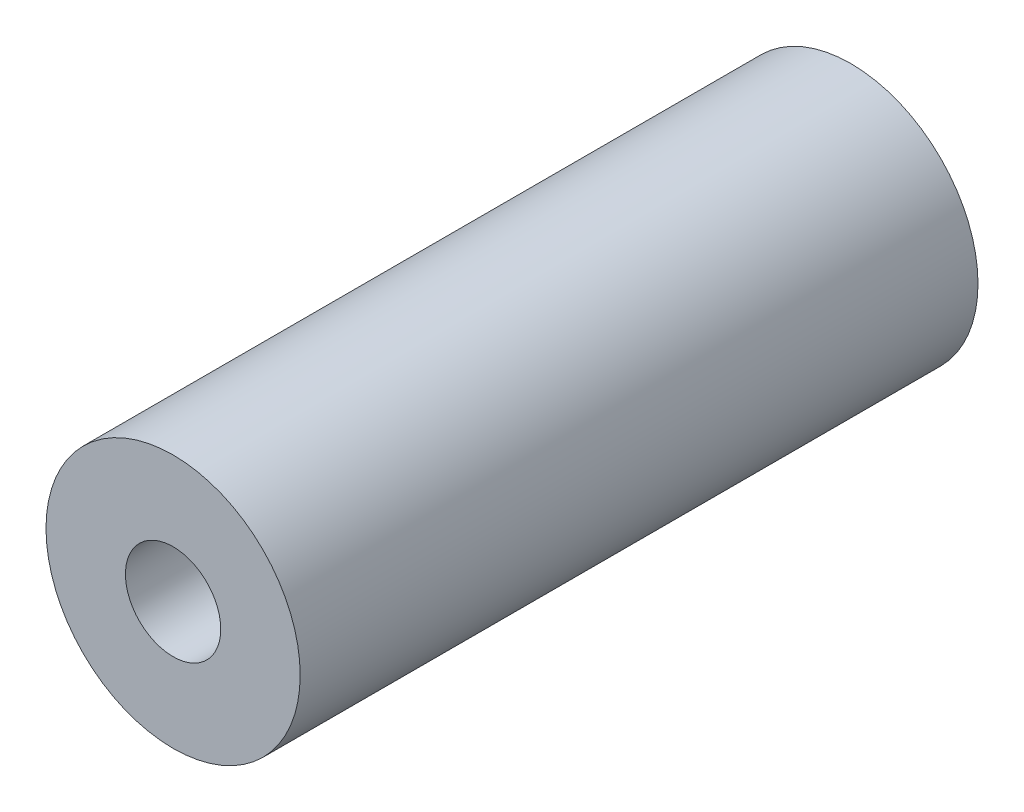
ISO-10303-21;
HEADER;
FILE_DESCRIPTION(('STEP AP214'),'2;1');
FILE_NAME('part.step','',(''),(''),'','','');
FILE_SCHEMA(('AUTOMOTIVE_DESIGN { 1 0 10303 214 1 1 1 1 }'));
ENDSEC;
DATA;
#1=APPLICATION_CONTEXT('core data for automotive mechanical design processes');
#2=APPLICATION_PROTOCOL_DEFINITION('international standard','automotive_design',2000,#1);
#3=PRODUCT_CONTEXT('',#1,'mechanical');
#4=PRODUCT('Part','Part','',(#3));
#5=PRODUCT_RELATED_PRODUCT_CATEGORY('part','',(#4));
#6=PRODUCT_DEFINITION_FORMATION('','',#4);
#7=PRODUCT_DEFINITION_CONTEXT('part definition',#1,'design');
#8=PRODUCT_DEFINITION('design','',#6,#7);
#9=PRODUCT_DEFINITION_SHAPE('','',#8);
#10=(LENGTH_UNIT() NAMED_UNIT(*) SI_UNIT(.MILLI.,.METRE.));
#11=(NAMED_UNIT(*) PLANE_ANGLE_UNIT() SI_UNIT($,.RADIAN.));
#12=(NAMED_UNIT(*) SI_UNIT($,.STERADIAN.) SOLID_ANGLE_UNIT());
#13=UNCERTAINTY_MEASURE_WITH_UNIT(LENGTH_MEASURE(1.E-05),#10,'distance_accuracy_value','');
#14=(GEOMETRIC_REPRESENTATION_CONTEXT(3) GLOBAL_UNCERTAINTY_ASSIGNED_CONTEXT((#13)) GLOBAL_UNIT_ASSIGNED_CONTEXT((#10,
#11,#12)) REPRESENTATION_CONTEXT('',''));
#15=CARTESIAN_POINT('',(0.,0.,0.));
#16=DIRECTION('',(0.,0.,1.));
#17=DIRECTION('',(1.,0.,0.));
#18=AXIS2_PLACEMENT_3D('',#15,#16,#17);
#19=CARTESIAN_POINT('',(0.,0.,25.4));
#20=DIRECTION('',(0.,0.,1.));
#21=DIRECTION('',(1.,0.,0.));
#22=AXIS2_PLACEMENT_3D('',#19,#20,#21);
#23=PLANE('',#22);
#24=CARTESIAN_POINT('',(0.,0.,25.4));
#25=DIRECTION('',(0.,0.,1.));
#26=DIRECTION('',(1.,0.,0.));
#27=AXIS2_PLACEMENT_3D('',#24,#25,#26);
#28=CIRCLE('',#27,4.7625);
#29=CARTESIAN_POINT('',(4.7625,0.,25.4));
#30=VERTEX_POINT('',#29);
#31=EDGE_CURVE('E10',#30,#30,#28,.T.);
#32=ORIENTED_EDGE('',*,*,#31,.T.);
#33=EDGE_LOOP('',(#32));
#34=FACE_BOUND('',#33,.T.);
#35=CARTESIAN_POINT('',(0.,0.,25.4));
#36=DIRECTION('',(0.,0.,1.));
#37=DIRECTION('',(1.,0.,0.));
#38=AXIS2_PLACEMENT_3D('',#35,#36,#37);
#39=CIRCLE('',#38,1.78562);
#40=CARTESIAN_POINT('',(1.78562,0.,25.4));
#41=VERTEX_POINT('',#40);
#42=EDGE_CURVE('E41',#41,#41,#39,.T.);
#43=ORIENTED_EDGE('',*,*,#42,.F.);
#44=EDGE_LOOP('',(#43));
#45=FACE_BOUND('',#44,.T.);
#46=ADVANCED_FACE('F30',(#34,#45),#23,.T.);
#47=CARTESIAN_POINT('',(0.,0.,0.));
#48=DIRECTION('',(0.,0.,1.));
#49=DIRECTION('',(1.,0.,0.));
#50=AXIS2_PLACEMENT_3D('',#47,#48,#49);
#51=PLANE('',#50);
#52=CARTESIAN_POINT('',(0.,0.,0.));
#53=DIRECTION('',(0.,0.,1.));
#54=DIRECTION('',(1.,0.,0.));
#55=AXIS2_PLACEMENT_3D('',#52,#53,#54);
#56=CIRCLE('',#55,4.7625);
#57=CARTESIAN_POINT('',(4.7625,0.,0.));
#58=VERTEX_POINT('',#57);
#59=EDGE_CURVE('E34',#58,#58,#56,.T.);
#60=ORIENTED_EDGE('',*,*,#59,.F.);
#61=EDGE_LOOP('',(#60));
#62=FACE_BOUND('',#61,.T.);
#63=CARTESIAN_POINT('',(0.,0.,0.));
#64=DIRECTION('',(0.,0.,1.));
#65=DIRECTION('',(1.,0.,0.));
#66=AXIS2_PLACEMENT_3D('',#63,#64,#65);
#67=CIRCLE('',#66,1.78562);
#68=CARTESIAN_POINT('',(1.78562,0.,0.));
#69=VERTEX_POINT('',#68);
#70=EDGE_CURVE('E43',#69,#69,#67,.T.);
#71=ORIENTED_EDGE('',*,*,#70,.T.);
#72=EDGE_LOOP('',(#71));
#73=FACE_BOUND('',#72,.T.);
#74=ADVANCED_FACE('F53',(#62,#73),#51,.F.);
#75=CARTESIAN_POINT('',(0.,0.,25.4));
#76=DIRECTION('',(0.,0.,-1.));
#77=DIRECTION('',(-1.,0.,0.));
#78=AXIS2_PLACEMENT_3D('',#75,#76,#77);
#79=CYLINDRICAL_SURFACE('',#78,4.7625);
#80=ORIENTED_EDGE('',*,*,#31,.F.);
#81=EDGE_LOOP('',(#80));
#82=FACE_BOUND('',#81,.T.);
#83=ORIENTED_EDGE('',*,*,#59,.T.);
#84=EDGE_LOOP('',(#83));
#85=FACE_BOUND('',#84,.T.);
#86=ADVANCED_FACE('F32',(#82,#85),#79,.T.);
#87=CARTESIAN_POINT('',(0.,0.,25.4));
#88=DIRECTION('',(0.,0.,-1.));
#89=DIRECTION('',(-1.,0.,0.));
#90=AXIS2_PLACEMENT_3D('',#87,#88,#89);
#91=CYLINDRICAL_SURFACE('',#90,1.78562);
#92=ORIENTED_EDGE('',*,*,#42,.T.);
#93=EDGE_LOOP('',(#92));
#94=FACE_BOUND('',#93,.T.);
#95=ORIENTED_EDGE('',*,*,#70,.F.);
#96=EDGE_LOOP('',(#95));
#97=FACE_BOUND('',#96,.T.);
#98=ADVANCED_FACE('F49',(#94,#97),#91,.F.);
#99=CLOSED_SHELL('',(#46,#74,#86,#98));
#100=MANIFOLD_SOLID_BREP('B2',#99);
#101=ADVANCED_BREP_SHAPE_REPRESENTATION('',(#18,#100),#14);
#102=SHAPE_DEFINITION_REPRESENTATION(#9,#101);
ENDSEC;
END-ISO-10303-21;
